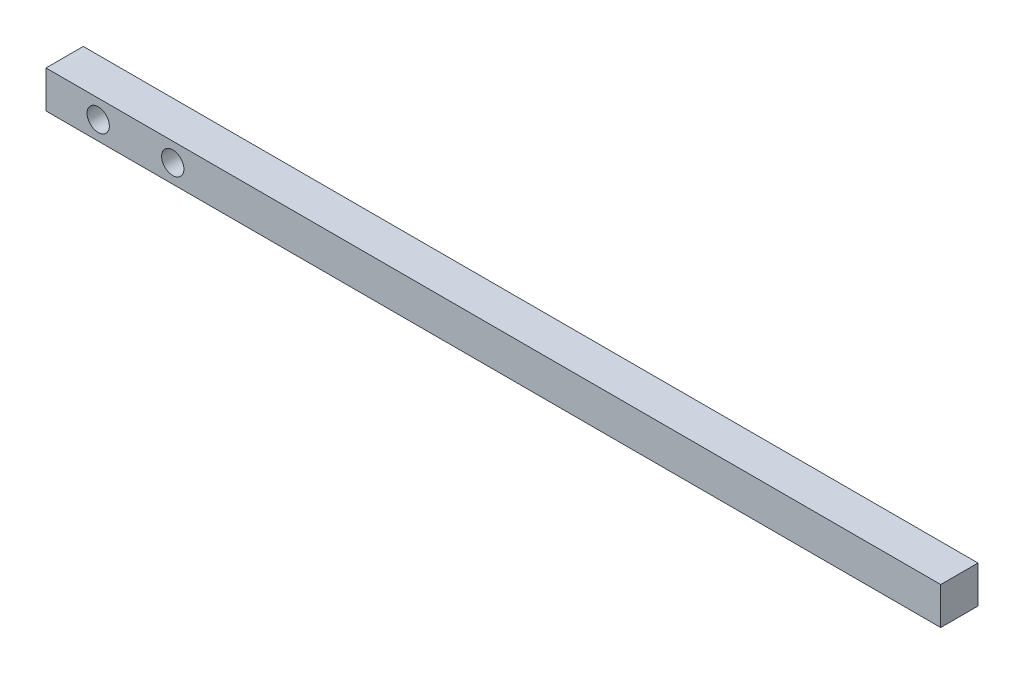
ISO-10303-21;
HEADER;
FILE_DESCRIPTION(('STEP AP214'),'2;1');
FILE_NAME('part.step','',(''),(''),'','','');
FILE_SCHEMA(('AUTOMOTIVE_DESIGN { 1 0 10303 214 1 1 1 1 }'));
ENDSEC;
DATA;
#1=APPLICATION_CONTEXT('core data for automotive mechanical design processes');
#2=APPLICATION_PROTOCOL_DEFINITION('international standard','automotive_design',2000,#1);
#3=PRODUCT_CONTEXT('',#1,'mechanical');
#4=PRODUCT('Part','Part','',(#3));
#5=PRODUCT_RELATED_PRODUCT_CATEGORY('part','',(#4));
#6=PRODUCT_DEFINITION_FORMATION('','',#4);
#7=PRODUCT_DEFINITION_CONTEXT('part definition',#1,'design');
#8=PRODUCT_DEFINITION('design','',#6,#7);
#9=PRODUCT_DEFINITION_SHAPE('','',#8);
#10=(LENGTH_UNIT() NAMED_UNIT(*) SI_UNIT(.MILLI.,.METRE.));
#11=(NAMED_UNIT(*) PLANE_ANGLE_UNIT() SI_UNIT($,.RADIAN.));
#12=(NAMED_UNIT(*) SI_UNIT($,.STERADIAN.) SOLID_ANGLE_UNIT());
#13=UNCERTAINTY_MEASURE_WITH_UNIT(LENGTH_MEASURE(1.E-05),#10,'distance_accuracy_value','');
#14=(GEOMETRIC_REPRESENTATION_CONTEXT(3) GLOBAL_UNCERTAINTY_ASSIGNED_CONTEXT((#13)) GLOBAL_UNIT_ASSIGNED_CONTEXT((#10,
#11,#12)) REPRESENTATION_CONTEXT('',''));
#15=CARTESIAN_POINT('',(0.,0.,0.));
#16=DIRECTION('',(0.,0.,1.));
#17=DIRECTION('',(1.,0.,0.));
#18=AXIS2_PLACEMENT_3D('',#15,#16,#17);
#19=CARTESIAN_POINT('',(76.2,-3.175,6.35));
#20=DIRECTION('',(-1.,0.,0.));
#21=DIRECTION('',(0.,0.,1.));
#22=AXIS2_PLACEMENT_3D('',#19,#20,#21);
#23=PLANE('',#22);
#24=DIRECTION('',(0.,1.,0.));
#25=VECTOR('',#24,1.);
#26=CARTESIAN_POINT('',(76.2,-3.175,0.));
#27=LINE('',#26,#25);
#28=CARTESIAN_POINT('',(76.2,-3.175,0.));
#29=VERTEX_POINT('',#28);
#30=CARTESIAN_POINT('',(76.2,3.175,0.));
#31=VERTEX_POINT('',#30);
#32=EDGE_CURVE('E98',#29,#31,#27,.T.);
#33=ORIENTED_EDGE('',*,*,#32,.T.);
#34=DIRECTION('',(0.,0.,-1.));
#35=VECTOR('',#34,1.);
#36=CARTESIAN_POINT('',(76.2,3.175,6.35));
#37=LINE('',#36,#35);
#38=CARTESIAN_POINT('',(76.2,3.175,6.35));
#39=VERTEX_POINT('',#38);
#40=EDGE_CURVE('E11',#39,#31,#37,.T.);
#41=ORIENTED_EDGE('',*,*,#40,.F.);
#42=DIRECTION('',(0.,1.,0.));
#43=VECTOR('',#42,1.);
#44=CARTESIAN_POINT('',(76.2,-3.175,6.35));
#45=LINE('',#44,#43);
#46=CARTESIAN_POINT('',(76.2,-3.175,6.35));
#47=VERTEX_POINT('',#46);
#48=EDGE_CURVE('E86',#47,#39,#45,.T.);
#49=ORIENTED_EDGE('',*,*,#48,.F.);
#50=DIRECTION('',(0.,0.,-1.));
#51=VECTOR('',#50,1.);
#52=CARTESIAN_POINT('',(76.2,-3.175,6.35));
#53=LINE('',#52,#51);
#54=EDGE_CURVE('E94',#47,#29,#53,.T.);
#55=ORIENTED_EDGE('',*,*,#54,.T.);
#56=EDGE_LOOP('',(#33,#41,#49,#55));
#57=FACE_BOUND('',#56,.T.);
#58=ADVANCED_FACE('F35',(#57),#23,.F.);
#59=CARTESIAN_POINT('',(-76.2,3.175,6.35));
#60=DIRECTION('',(0.,-1.,0.));
#61=DIRECTION('',(0.,0.,-1.));
#62=AXIS2_PLACEMENT_3D('',#59,#60,#61);
#63=PLANE('',#62);
#64=DIRECTION('',(-1.,0.,0.));
#65=VECTOR('',#64,1.);
#66=CARTESIAN_POINT('',(-76.2,3.175,0.));
#67=LINE('',#66,#65);
#68=CARTESIAN_POINT('',(-76.2,3.175,0.));
#69=VERTEX_POINT('',#68);
#70=EDGE_CURVE('E90',#31,#69,#67,.T.);
#71=ORIENTED_EDGE('',*,*,#70,.T.);
#72=DIRECTION('',(0.,0.,-1.));
#73=VECTOR('',#72,1.);
#74=CARTESIAN_POINT('',(-76.2,3.175,6.35));
#75=LINE('',#74,#73);
#76=CARTESIAN_POINT('',(-76.2,3.175,6.35));
#77=VERTEX_POINT('',#76);
#78=EDGE_CURVE('E43',#77,#69,#75,.T.);
#79=ORIENTED_EDGE('',*,*,#78,.F.);
#80=DIRECTION('',(-1.,0.,0.));
#81=VECTOR('',#80,1.);
#82=CARTESIAN_POINT('',(-76.2,3.175,6.35));
#83=LINE('',#82,#81);
#84=EDGE_CURVE('E81',#39,#77,#83,.T.);
#85=ORIENTED_EDGE('',*,*,#84,.F.);
#86=ORIENTED_EDGE('',*,*,#40,.T.);
#87=EDGE_LOOP('',(#71,#79,#85,#86));
#88=FACE_BOUND('',#87,.T.);
#89=ADVANCED_FACE('F89',(#88),#63,.F.);
#90=CARTESIAN_POINT('',(-76.2,-3.175,6.35));
#91=DIRECTION('',(1.,0.,0.));
#92=DIRECTION('',(0.,0.,-1.));
#93=AXIS2_PLACEMENT_3D('',#90,#91,#92);
#94=PLANE('',#93);
#95=DIRECTION('',(0.,-1.,0.));
#96=VECTOR('',#95,1.);
#97=CARTESIAN_POINT('',(-76.2,-3.175,0.));
#98=LINE('',#97,#96);
#99=CARTESIAN_POINT('',(-76.2,-3.175,0.));
#100=VERTEX_POINT('',#99);
#101=EDGE_CURVE('E68',#69,#100,#98,.T.);
#102=ORIENTED_EDGE('',*,*,#101,.T.);
#103=DIRECTION('',(0.,0.,-1.));
#104=VECTOR('',#103,1.);
#105=CARTESIAN_POINT('',(-76.2,-3.175,6.35));
#106=LINE('',#105,#104);
#107=CARTESIAN_POINT('',(-76.2,-3.175,6.35));
#108=VERTEX_POINT('',#107);
#109=EDGE_CURVE('E91',#108,#100,#106,.T.);
#110=ORIENTED_EDGE('',*,*,#109,.F.);
#111=DIRECTION('',(0.,-1.,0.));
#112=VECTOR('',#111,1.);
#113=CARTESIAN_POINT('',(-76.2,-3.175,6.35));
#114=LINE('',#113,#112);
#115=EDGE_CURVE('E84',#77,#108,#114,.T.);
#116=ORIENTED_EDGE('',*,*,#115,.F.);
#117=ORIENTED_EDGE('',*,*,#78,.T.);
#118=EDGE_LOOP('',(#102,#110,#116,#117));
#119=FACE_BOUND('',#118,.T.);
#120=ADVANCED_FACE('F92',(#119),#94,.F.);
#121=CARTESIAN_POINT('',(-76.2,-3.175,6.35));
#122=DIRECTION('',(0.,1.,0.));
#123=DIRECTION('',(0.,0.,1.));
#124=AXIS2_PLACEMENT_3D('',#121,#122,#123);
#125=PLANE('',#124);
#126=DIRECTION('',(1.,0.,0.));
#127=VECTOR('',#126,1.);
#128=CARTESIAN_POINT('',(-76.2,-3.175,0.));
#129=LINE('',#128,#127);
#130=EDGE_CURVE('E74',#100,#29,#129,.T.);
#131=ORIENTED_EDGE('',*,*,#130,.T.);
#132=ORIENTED_EDGE('',*,*,#54,.F.);
#133=DIRECTION('',(1.,0.,0.));
#134=VECTOR('',#133,1.);
#135=CARTESIAN_POINT('',(-76.2,-3.175,6.35));
#136=LINE('',#135,#134);
#137=EDGE_CURVE('E51',#108,#47,#136,.T.);
#138=ORIENTED_EDGE('',*,*,#137,.F.);
#139=ORIENTED_EDGE('',*,*,#109,.T.);
#140=EDGE_LOOP('',(#131,#132,#138,#139));
#141=FACE_BOUND('',#140,.T.);
#142=ADVANCED_FACE('F106',(#141),#125,.F.);
#143=CARTESIAN_POINT('',(0.,0.,6.35));
#144=DIRECTION('',(0.,0.,-1.));
#145=DIRECTION('',(-1.,0.,0.));
#146=AXIS2_PLACEMENT_3D('',#143,#144,#145);
#147=PLANE('',#146);
#148=CARTESIAN_POINT('',(-67.31,0.,6.35));
#149=DIRECTION('',(0.,0.,1.));
#150=DIRECTION('',(1.,0.,0.));
#151=AXIS2_PLACEMENT_3D('',#148,#149,#150);
#152=CIRCLE('',#151,1.89864999999999);
#153=CARTESIAN_POINT('',(-65.41135,0.,6.35));
#154=VERTEX_POINT('',#153);
#155=EDGE_CURVE('E120',#154,#154,#152,.T.);
#156=ORIENTED_EDGE('',*,*,#155,.F.);
#157=EDGE_LOOP('',(#156));
#158=FACE_BOUND('',#157,.T.);
#159=CARTESIAN_POINT('',(-54.61,0.,6.35));
#160=DIRECTION('',(0.,0.,1.));
#161=DIRECTION('',(1.,0.,0.));
#162=AXIS2_PLACEMENT_3D('',#159,#160,#161);
#163=CIRCLE('',#162,1.89864999999999);
#164=CARTESIAN_POINT('',(-52.71135,0.,6.35));
#165=VERTEX_POINT('',#164);
#166=EDGE_CURVE('E114',#165,#165,#163,.T.);
#167=ORIENTED_EDGE('',*,*,#166,.F.);
#168=EDGE_LOOP('',(#167));
#169=FACE_BOUND('',#168,.T.);
#170=ORIENTED_EDGE('',*,*,#48,.T.);
#171=ORIENTED_EDGE('',*,*,#84,.T.);
#172=ORIENTED_EDGE('',*,*,#115,.T.);
#173=ORIENTED_EDGE('',*,*,#137,.T.);
#174=EDGE_LOOP('',(#170,#171,#172,#173));
#175=FACE_BOUND('',#174,.T.);
#176=ADVANCED_FACE('F82',(#158,#169,#175),#147,.F.);
#177=CARTESIAN_POINT('',(0.,0.,0.));
#178=DIRECTION('',(0.,0.,-1.));
#179=DIRECTION('',(-1.,0.,0.));
#180=AXIS2_PLACEMENT_3D('',#177,#178,#179);
#181=PLANE('',#180);
#182=CARTESIAN_POINT('',(-67.31,0.,0.));
#183=DIRECTION('',(0.,0.,1.));
#184=DIRECTION('',(1.,0.,0.));
#185=AXIS2_PLACEMENT_3D('',#182,#183,#184);
#186=CIRCLE('',#185,1.89865);
#187=CARTESIAN_POINT('',(-65.41135,0.,0.));
#188=VERTEX_POINT('',#187);
#189=EDGE_CURVE('E117',#188,#188,#186,.T.);
#190=ORIENTED_EDGE('',*,*,#189,.T.);
#191=EDGE_LOOP('',(#190));
#192=FACE_BOUND('',#191,.T.);
#193=CARTESIAN_POINT('',(-54.61,0.,0.));
#194=DIRECTION('',(0.,0.,1.));
#195=DIRECTION('',(1.,0.,0.));
#196=AXIS2_PLACEMENT_3D('',#193,#194,#195);
#197=CIRCLE('',#196,1.89864999999999);
#198=CARTESIAN_POINT('',(-52.71135,0.,0.));
#199=VERTEX_POINT('',#198);
#200=EDGE_CURVE('E101',#199,#199,#197,.T.);
#201=ORIENTED_EDGE('',*,*,#200,.T.);
#202=EDGE_LOOP('',(#201));
#203=FACE_BOUND('',#202,.T.);
#204=ORIENTED_EDGE('',*,*,#32,.F.);
#205=ORIENTED_EDGE('',*,*,#130,.F.);
#206=ORIENTED_EDGE('',*,*,#101,.F.);
#207=ORIENTED_EDGE('',*,*,#70,.F.);
#208=EDGE_LOOP('',(#204,#205,#206,#207));
#209=FACE_BOUND('',#208,.T.);
#210=ADVANCED_FACE('F109',(#192,#203,#209),#181,.T.);
#211=CARTESIAN_POINT('',(-54.61,0.,6.35));
#212=DIRECTION('',(0.,0.,1.));
#213=DIRECTION('',(1.,0.,0.));
#214=AXIS2_PLACEMENT_3D('',#211,#212,#213);
#215=CYLINDRICAL_SURFACE('',#214,1.89864999999999);
#216=ORIENTED_EDGE('',*,*,#200,.F.);
#217=EDGE_LOOP('',(#216));
#218=FACE_BOUND('',#217,.T.);
#219=ORIENTED_EDGE('',*,*,#166,.T.);
#220=EDGE_LOOP('',(#219));
#221=FACE_BOUND('',#220,.T.);
#222=ADVANCED_FACE('F131',(#218,#221),#215,.F.);
#223=CARTESIAN_POINT('',(-67.31,0.,6.35));
#224=DIRECTION('',(0.,0.,1.));
#225=DIRECTION('',(1.,0.,0.));
#226=AXIS2_PLACEMENT_3D('',#223,#224,#225);
#227=CYLINDRICAL_SURFACE('',#226,1.89864999999999);
#228=ORIENTED_EDGE('',*,*,#189,.F.);
#229=EDGE_LOOP('',(#228));
#230=FACE_BOUND('',#229,.T.);
#231=ORIENTED_EDGE('',*,*,#155,.T.);
#232=EDGE_LOOP('',(#231));
#233=FACE_BOUND('',#232,.T.);
#234=ADVANCED_FACE('F124',(#230,#233),#227,.F.);
#235=CLOSED_SHELL('',(#58,#89,#120,#142,#176,#210,#222,#234));
#236=MANIFOLD_SOLID_BREP('B2',#235);
#237=ADVANCED_BREP_SHAPE_REPRESENTATION('',(#18,#236),#14);
#238=SHAPE_DEFINITION_REPRESENTATION(#9,#237);
ENDSEC;
END-ISO-10303-21;
